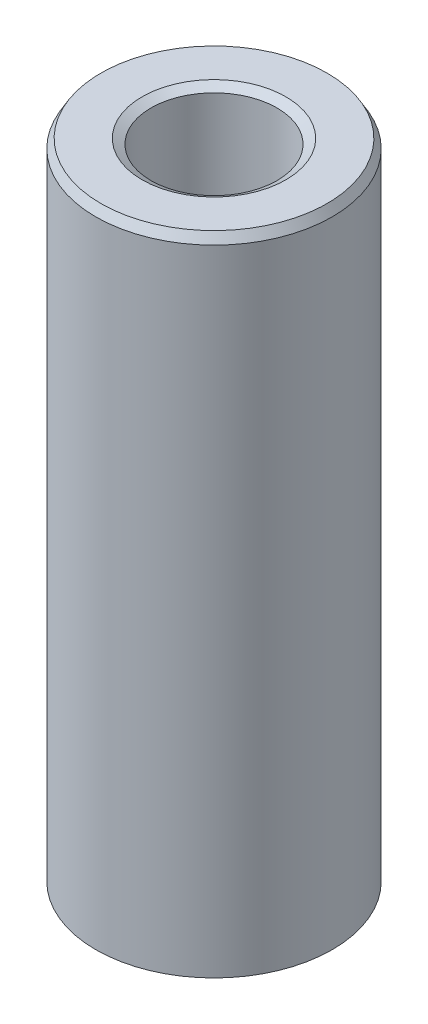
ISO-10303-21;
HEADER;
FILE_DESCRIPTION(('STEP AP214'),'2;1');
FILE_NAME('part.step','',(''),(''),'','','');
FILE_SCHEMA(('AUTOMOTIVE_DESIGN { 1 0 10303 214 1 1 1 1 }'));
ENDSEC;
DATA;
#1=APPLICATION_CONTEXT('core data for automotive mechanical design processes');
#2=APPLICATION_PROTOCOL_DEFINITION('international standard','automotive_design',2000,#1);
#3=PRODUCT_CONTEXT('',#1,'mechanical');
#4=PRODUCT('Part','Part','',(#3));
#5=PRODUCT_RELATED_PRODUCT_CATEGORY('part','',(#4));
#6=PRODUCT_DEFINITION_FORMATION('','',#4);
#7=PRODUCT_DEFINITION_CONTEXT('part definition',#1,'design');
#8=PRODUCT_DEFINITION('design','',#6,#7);
#9=PRODUCT_DEFINITION_SHAPE('','',#8);
#10=(LENGTH_UNIT() NAMED_UNIT(*) SI_UNIT(.MILLI.,.METRE.));
#11=(NAMED_UNIT(*) PLANE_ANGLE_UNIT() SI_UNIT($,.RADIAN.));
#12=(NAMED_UNIT(*) SI_UNIT($,.STERADIAN.) SOLID_ANGLE_UNIT());
#13=UNCERTAINTY_MEASURE_WITH_UNIT(LENGTH_MEASURE(1.E-05),#10,'distance_accuracy_value','');
#14=(GEOMETRIC_REPRESENTATION_CONTEXT(3) GLOBAL_UNCERTAINTY_ASSIGNED_CONTEXT((#13)) GLOBAL_UNIT_ASSIGNED_CONTEXT((#10,
#11,#12)) REPRESENTATION_CONTEXT('',''));
#15=CARTESIAN_POINT('',(0.,0.,0.));
#16=DIRECTION('',(0.,0.,1.));
#17=DIRECTION('',(1.,0.,0.));
#18=AXIS2_PLACEMENT_3D('',#15,#16,#17);
#19=CARTESIAN_POINT('',(0.,246.915724607345,0.));
#20=DIRECTION('',(0.,-1.,0.));
#21=DIRECTION('',(0.,0.,-1.));
#22=AXIS2_PLACEMENT_3D('',#19,#20,#21);
#23=CYLINDRICAL_SURFACE('',#22,45.);
#24=CARTESIAN_POINT('',(0.,1.96398894464445,0.));
#25=DIRECTION('',(0.,1.,0.));
#26=DIRECTION('',(0.,0.,1.));
#27=AXIS2_PLACEMENT_3D('',#24,#25,#26);
#28=CIRCLE('',#27,45.);
#29=CARTESIAN_POINT('',(0.,1.96398894464445,45.));
#30=VERTEX_POINT('',#29);
#31=EDGE_CURVE('E10',#30,#30,#28,.T.);
#32=ORIENTED_EDGE('',*,*,#31,.T.);
#33=EDGE_LOOP('',(#32));
#34=FACE_BOUND('',#33,.T.);
#35=CARTESIAN_POINT('',(0.,243.513995969717,0.));
#36=DIRECTION('',(0.,1.,0.));
#37=DIRECTION('',(0.,0.,1.));
#38=AXIS2_PLACEMENT_3D('',#35,#36,#37);
#39=CIRCLE('',#38,45.);
#40=CARTESIAN_POINT('',(0.,243.513995969717,45.));
#41=VERTEX_POINT('',#40);
#42=EDGE_CURVE('E50',#41,#41,#39,.F.);
#43=ORIENTED_EDGE('',*,*,#42,.T.);
#44=EDGE_LOOP('',(#43));
#45=FACE_BOUND('',#44,.T.);
#46=ADVANCED_FACE('F39',(#34,#45),#23,.T.);
#47=CARTESIAN_POINT('',(0.,246.915724607345,0.));
#48=DIRECTION('',(0.,1.,0.));
#49=DIRECTION('',(0.,0.,1.));
#50=AXIS2_PLACEMENT_3D('',#47,#48,#49);
#51=PLANE('',#50);
#52=CARTESIAN_POINT('',(0.,246.915724607345,0.));
#53=DIRECTION('',(0.,1.,0.));
#54=DIRECTION('',(0.,0.,1.));
#55=AXIS2_PLACEMENT_3D('',#52,#53,#54);
#56=CIRCLE('',#55,27.37995425817);
#57=CARTESIAN_POINT('',(0.,246.915724607345,27.37995425817));
#58=VERTEX_POINT('',#57);
#59=EDGE_CURVE('E58',#58,#58,#56,.F.);
#60=ORIENTED_EDGE('',*,*,#59,.T.);
#61=EDGE_LOOP('',(#60));
#62=FACE_BOUND('',#61,.T.);
#63=CARTESIAN_POINT('',(0.,246.915724607345,0.));
#64=DIRECTION('',(0.,1.,0.));
#65=DIRECTION('',(0.,0.,1.));
#66=AXIS2_PLACEMENT_3D('',#63,#64,#65);
#67=CIRCLE('',#66,43.0360110553555);
#68=CARTESIAN_POINT('',(0.,246.915724607345,43.0360110553555));
#69=VERTEX_POINT('',#68);
#70=EDGE_CURVE('E61',#69,#69,#67,.T.);
#71=ORIENTED_EDGE('',*,*,#70,.T.);
#72=EDGE_LOOP('',(#71));
#73=FACE_BOUND('',#72,.T.);
#74=ADVANCED_FACE('F88',(#62,#73),#51,.T.);
#75=CARTESIAN_POINT('',(0.,0.,0.));
#76=DIRECTION('',(0.,1.,0.));
#77=DIRECTION('',(0.,0.,1.));
#78=AXIS2_PLACEMENT_3D('',#75,#76,#77);
#79=PLANE('',#78);
#80=CARTESIAN_POINT('',(0.,0.,0.));
#81=DIRECTION('',(0.,1.,0.));
#82=DIRECTION('',(0.,0.,1.));
#83=AXIS2_PLACEMENT_3D('',#80,#81,#82);
#84=CIRCLE('',#83,25.9422145651867);
#85=CARTESIAN_POINT('',(0.,0.,-25.9422145651867));
#86=VERTEX_POINT('',#85);
#87=EDGE_CURVE('E51',#86,#86,#84,.T.);
#88=ORIENTED_EDGE('',*,*,#87,.T.);
#89=EDGE_LOOP('',(#88));
#90=FACE_BOUND('',#89,.T.);
#91=CARTESIAN_POINT('',(0.,0.,0.));
#92=DIRECTION('',(0.,1.,0.));
#93=DIRECTION('',(0.,0.,1.));
#94=AXIS2_PLACEMENT_3D('',#91,#92,#93);
#95=CIRCLE('',#94,41.5982713623722);
#96=CARTESIAN_POINT('',(0.,0.,41.5982713623722));
#97=VERTEX_POINT('',#96);
#98=EDGE_CURVE('E54',#97,#97,#95,.F.);
#99=ORIENTED_EDGE('',*,*,#98,.T.);
#100=EDGE_LOOP('',(#99));
#101=FACE_BOUND('',#100,.T.);
#102=ADVANCED_FACE('F83',(#90,#101),#79,.F.);
#103=CARTESIAN_POINT('',(0.,246.915724607345,0.));
#104=DIRECTION('',(0.,-1.,0.));
#105=DIRECTION('',(0.,0.,-1.));
#106=AXIS2_PLACEMENT_3D('',#103,#104,#105);
#107=CYLINDRICAL_SURFACE('',#106,23.9782256205422);
#108=CARTESIAN_POINT('',(0.,244.9517356627,0.));
#109=DIRECTION('',(0.,1.,0.));
#110=DIRECTION('',(0.,0.,1.));
#111=AXIS2_PLACEMENT_3D('',#108,#109,#110);
#112=CIRCLE('',#111,23.9782256205422);
#113=CARTESIAN_POINT('',(0.,244.9517356627,23.9782256205422));
#114=VERTEX_POINT('',#113);
#115=EDGE_CURVE('E67',#114,#114,#112,.T.);
#116=ORIENTED_EDGE('',*,*,#115,.T.);
#117=EDGE_LOOP('',(#116));
#118=FACE_BOUND('',#117,.T.);
#119=CARTESIAN_POINT('',(0.,3.40172863762783,0.));
#120=DIRECTION('',(0.,1.,0.));
#121=DIRECTION('',(0.,0.,1.));
#122=AXIS2_PLACEMENT_3D('',#119,#120,#121);
#123=CIRCLE('',#122,23.9782256205422);
#124=CARTESIAN_POINT('',(0.,3.40172863762783,-23.9782256205422));
#125=VERTEX_POINT('',#124);
#126=EDGE_CURVE('E69',#125,#125,#123,.F.);
#127=ORIENTED_EDGE('',*,*,#126,.T.);
#128=EDGE_LOOP('',(#127));
#129=FACE_BOUND('',#128,.T.);
#130=ADVANCED_FACE('F71',(#118,#129),#107,.F.);
#131=CARTESIAN_POINT('',(0.,244.9517356627,0.));
#132=DIRECTION('',(0.,1.,0.));
#133=DIRECTION('',(0.,0.,1.));
#134=AXIS2_PLACEMENT_3D('',#131,#132,#133);
#135=CONICAL_SURFACE('',#134,23.9782256205422,1.0471975511966);
#136=ORIENTED_EDGE('',*,*,#59,.F.);
#137=EDGE_LOOP('',(#136));
#138=FACE_BOUND('',#137,.T.);
#139=ORIENTED_EDGE('',*,*,#115,.F.);
#140=EDGE_LOOP('',(#139));
#141=FACE_BOUND('',#140,.T.);
#142=ADVANCED_FACE('F77',(#138,#141),#135,.F.);
#143=CARTESIAN_POINT('',(0.,0.,0.));
#144=DIRECTION('',(0.,-1.,0.));
#145=DIRECTION('',(0.,0.,-1.));
#146=AXIS2_PLACEMENT_3D('',#143,#144,#145);
#147=CONICAL_SURFACE('',#146,25.9422145651867,0.523598775598299);
#148=CARTESIAN_POINT('',(0.,3.40172863762783,-23.9782256205422));
#149=CARTESIAN_POINT('',(0.,3.36629396431921,-23.9986838387155));
#150=CARTESIAN_POINT('',(0.,3.33085929101058,-24.0191420568889));
#151=CARTESIAN_POINT('',(0.,3.25998994439334,-24.0600584932357));
#152=CARTESIAN_POINT('',(0.,3.22455527108472,-24.0805167114091));
#153=CARTESIAN_POINT('',(0.,3.15368592446747,-24.1214331477558));
#154=CARTESIAN_POINT('',(0.,3.11825125115885,-24.1418913659292));
#155=CARTESIAN_POINT('',(0.,3.0473819045416,-24.182807802276));
#156=CARTESIAN_POINT('',(0.,3.01194723123298,-24.2032660204493));
#157=CARTESIAN_POINT('',(0.,2.94107788461573,-24.2441824567961));
#158=CARTESIAN_POINT('',(0.,2.90564321130711,-24.2646406749695));
#159=CARTESIAN_POINT('',(0.,2.83477386468986,-24.3055571113162));
#160=CARTESIAN_POINT('',(0.,2.79933919138124,-24.3260153294896));
#161=CARTESIAN_POINT('',(0.,2.72846984476399,-24.3669317658364));
#162=CARTESIAN_POINT('',(0.,2.69303517145537,-24.3873899840098));
#163=CARTESIAN_POINT('',(0.,2.62216582483812,-24.4283064203565));
#164=CARTESIAN_POINT('',(0.,2.5867311515295,-24.4487646385299));
#165=CARTESIAN_POINT('',(0.,2.51586180491225,-24.4896810748767));
#166=CARTESIAN_POINT('',(0.,2.48042713160363,-24.51013929305));
#167=CARTESIAN_POINT('',(0.,2.40955778498638,-24.5510557293968));
#168=CARTESIAN_POINT('',(0.,2.37412311167776,-24.5715139475702));
#169=CARTESIAN_POINT('',(0.,2.30325376506051,-24.6124303839169));
#170=CARTESIAN_POINT('',(0.,2.26781909175189,-24.6328886020903));
#171=CARTESIAN_POINT('',(0.,2.19694974513464,-24.6738050384371));
#172=CARTESIAN_POINT('',(0.,2.16151507182602,-24.6942632566105));
#173=CARTESIAN_POINT('',(0.,2.09064572520877,-24.7351796929572));
#174=CARTESIAN_POINT('',(0.,2.05521105190015,-24.7556379111306));
#175=CARTESIAN_POINT('',(0.,1.9843417052829,-24.7965543474774));
#176=CARTESIAN_POINT('',(0.,1.94890703197428,-24.8170125656507));
#177=CARTESIAN_POINT('',(0.,1.87803768535703,-24.8579290019975));
#178=CARTESIAN_POINT('',(0.,1.84260301204841,-24.8783872201709));
#179=CARTESIAN_POINT('',(0.,1.77173366543116,-24.9193036565176));
#180=CARTESIAN_POINT('',(0.,1.73629899212254,-24.939761874691));
#181=CARTESIAN_POINT('',(0.,1.66542964550529,-24.9806783110378));
#182=CARTESIAN_POINT('',(0.,1.62999497219667,-25.0011365292112));
#183=CARTESIAN_POINT('',(0.,1.55912562557942,-25.0420529655579));
#184=CARTESIAN_POINT('',(0.,1.5236909522708,-25.0625111837313));
#185=CARTESIAN_POINT('',(0.,1.45282160565355,-25.1034276200781));
#186=CARTESIAN_POINT('',(0.,1.41738693234493,-25.1238858382515));
#187=CARTESIAN_POINT('',(0.,1.34651758572768,-25.1648022745982));
#188=CARTESIAN_POINT('',(0.,1.31108291241906,-25.1852604927716));
#189=CARTESIAN_POINT('',(0.,1.24021356580181,-25.2261769291184));
#190=CARTESIAN_POINT('',(0.,1.20477889249319,-25.2466351472917));
#191=CARTESIAN_POINT('',(0.,1.13390954587594,-25.2875515836385));
#192=CARTESIAN_POINT('',(0.,1.09847487256732,-25.3080098018119));
#193=CARTESIAN_POINT('',(0.,1.02760552595007,-25.3489262381586));
#194=CARTESIAN_POINT('',(0.,0.992170852641451,-25.369384456332));
#195=CARTESIAN_POINT('',(0.,0.921301506024205,-25.4103008926788));
#196=CARTESIAN_POINT('',(0.,0.885866832715581,-25.4307591108522));
#197=CARTESIAN_POINT('',(0.,0.814997486098334,-25.4716755471989));
#198=CARTESIAN_POINT('',(0.,0.779562812789711,-25.4921337653723));
#199=CARTESIAN_POINT('',(0.,0.708693466172465,-25.533050201719));
#200=CARTESIAN_POINT('',(0.,0.673258792863842,-25.5535084198924));
#201=CARTESIAN_POINT('',(0.,0.602389446246596,-25.5944248562392));
#202=CARTESIAN_POINT('',(0.,0.566954772937972,-25.6148830744126));
#203=CARTESIAN_POINT('',(0.,0.496085426320725,-25.6557995107593));
#204=CARTESIAN_POINT('',(0.,0.460650753012102,-25.6762577289327));
#205=CARTESIAN_POINT('',(0.,0.389781406394856,-25.7171741652795));
#206=CARTESIAN_POINT('',(0.,0.354346733086233,-25.7376323834529));
#207=CARTESIAN_POINT('',(0.,0.283477386468986,-25.7785488197996));
#208=CARTESIAN_POINT('',(0.,0.248042713160363,-25.799007037973));
#209=CARTESIAN_POINT('',(0.,0.177173366543116,-25.8399234743198));
#210=CARTESIAN_POINT('',(0.,0.141738693234493,-25.8603816924931));
#211=CARTESIAN_POINT('',(0.,0.070869346617247,-25.9012981288399));
#212=CARTESIAN_POINT('',(0.,0.0354346733086241,-25.9217563470133));
#213=CARTESIAN_POINT('',(0.,0.,-25.9422145651867));
#214=B_SPLINE_CURVE_WITH_KNOTS('',3,(#148,#149,#150,#151,#152,#153,#154,#155,#156,#157,#158,
#159,#160,#161,#162,#163,#164,#165,#166,#167,#168,#169,#170,#171,#172,#173,#174,#175,#176,#177,
#178,#179,#180,#181,#182,#183,#184,#185,#186,#187,#188,#189,#190,#191,#192,#193,#194,#195,#196,
#197,#198,#199,#200,#201,#202,#203,#204,#205,#206,#207,#208,#209,#210,#211,#212,#213),
.UNSPECIFIED.,.F.,.F.,(4,2,2,2,2,2,2,2,2,2,2,2,2,2,2,2,2,2,2,2,2,2,2,2,2,2,2,2,2,2,2,2,4),(0.,
0.12274930904028,0.245498618080561,0.368247927120841,0.490997236161123,0.613746545201403,
0.736495854241683,0.859245163281964,0.981994472322244,1.10474378136252,1.22749309040281,
1.35024239944309,1.47299170848337,1.59574101752365,1.71849032656393,1.84123963560421,
1.96398894464449,2.08673825368477,2.20948756272505,2.33223687176533,2.45498618080561,
2.57773548984589,2.70048479888617,2.82323410792645,2.94598341696673,3.06873272600701,
3.19148203504729,3.31423134408757,3.43698065312785,3.55972996216814,3.68247927120842,
3.8052285802487,3.92797788928898),.UNSPECIFIED.);
#215=EDGE_CURVE('BSEAM73',#125,#86,#214,.T.);
#216=ORIENTED_EDGE('',*,*,#126,.F.);
#217=ORIENTED_EDGE('',*,*,#87,.F.);
#218=ORIENTED_EDGE('',*,*,#215,.T.);
#219=ORIENTED_EDGE('',*,*,#215,.F.);
#220=EDGE_LOOP('',(#216,#218,#217,#219));
#221=FACE_BOUND('',#220,.T.);
#222=ADVANCED_FACE('F73',(#221),#147,.F.);
#223=CARTESIAN_POINT('',(0.,1.96398894464445,0.));
#224=DIRECTION('',(0.,1.,0.));
#225=DIRECTION('',(0.,0.,1.));
#226=AXIS2_PLACEMENT_3D('',#223,#224,#225);
#227=CONICAL_SURFACE('',#226,45.,1.0471975511966);
#228=ORIENTED_EDGE('',*,*,#98,.F.);
#229=EDGE_LOOP('',(#228));
#230=FACE_BOUND('',#229,.T.);
#231=ORIENTED_EDGE('',*,*,#31,.F.);
#232=EDGE_LOOP('',(#231));
#233=FACE_BOUND('',#232,.T.);
#234=ADVANCED_FACE('F76',(#230,#233),#227,.T.);
#235=CARTESIAN_POINT('',(0.,246.915724607345,0.));
#236=DIRECTION('',(0.,-1.,0.));
#237=DIRECTION('',(0.,0.,-1.));
#238=AXIS2_PLACEMENT_3D('',#235,#236,#237);
#239=CONICAL_SURFACE('',#238,43.0360110553555,0.523598775598293);
#240=ORIENTED_EDGE('',*,*,#42,.F.);
#241=EDGE_LOOP('',(#240));
#242=FACE_BOUND('',#241,.T.);
#243=ORIENTED_EDGE('',*,*,#70,.F.);
#244=EDGE_LOOP('',(#243));
#245=FACE_BOUND('',#244,.T.);
#246=ADVANCED_FACE('F45',(#242,#245),#239,.T.);
#247=CLOSED_SHELL('',(#46,#74,#102,#130,#142,#222,#234,#246));
#248=MANIFOLD_SOLID_BREP('B2',#247);
#249=ADVANCED_BREP_SHAPE_REPRESENTATION('',(#18,#248),#14);
#250=SHAPE_DEFINITION_REPRESENTATION(#9,#249);
ENDSEC;
END-ISO-10303-21;
